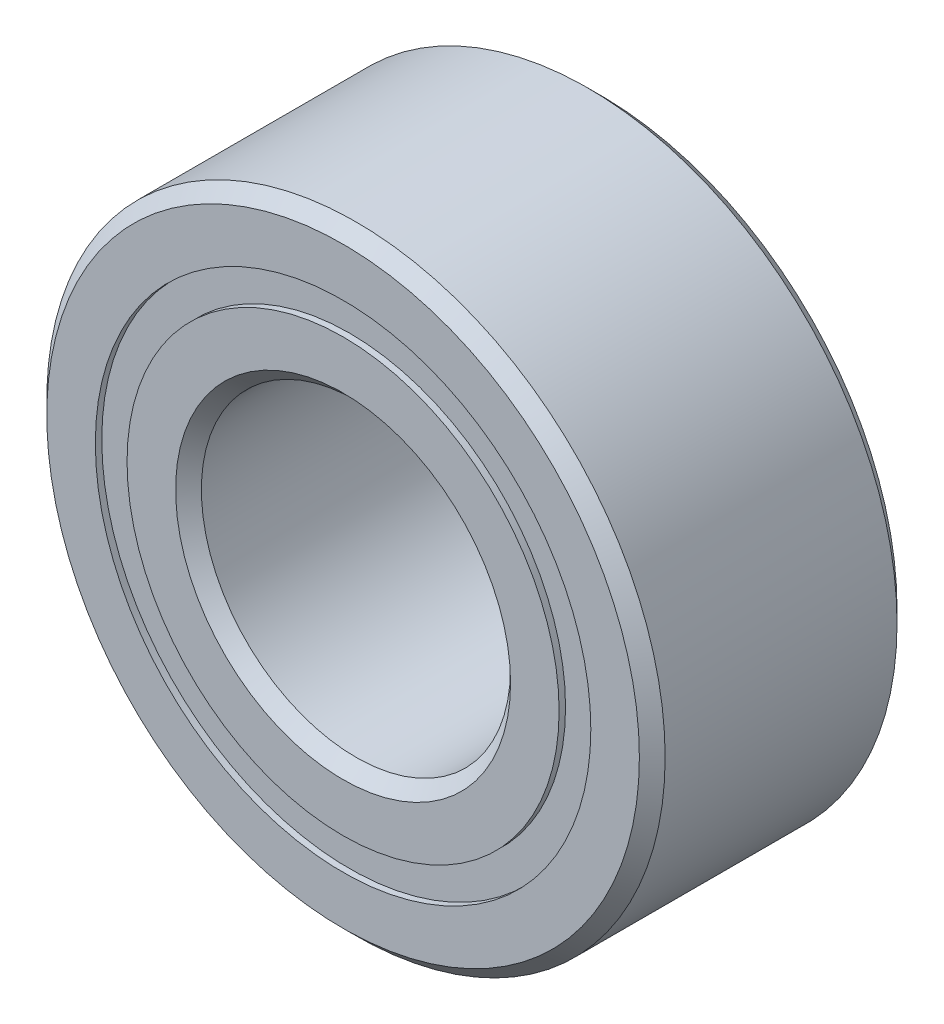
ISO-10303-21;
HEADER;
FILE_DESCRIPTION(('STEP AP214'),'2;1');
FILE_NAME('part.step','',(''),(''),'','','');
FILE_SCHEMA(('AUTOMOTIVE_DESIGN { 1 0 10303 214 1 1 1 1 }'));
ENDSEC;
DATA;
#1=APPLICATION_CONTEXT('core data for automotive mechanical design processes');
#2=APPLICATION_PROTOCOL_DEFINITION('international standard','automotive_design',2000,#1);
#3=PRODUCT_CONTEXT('',#1,'mechanical');
#4=PRODUCT('Part','Part','',(#3));
#5=PRODUCT_RELATED_PRODUCT_CATEGORY('part','',(#4));
#6=PRODUCT_DEFINITION_FORMATION('','',#4);
#7=PRODUCT_DEFINITION_CONTEXT('part definition',#1,'design');
#8=PRODUCT_DEFINITION('design','',#6,#7);
#9=PRODUCT_DEFINITION_SHAPE('','',#8);
#10=(LENGTH_UNIT() NAMED_UNIT(*) SI_UNIT(.MILLI.,.METRE.));
#11=(NAMED_UNIT(*) PLANE_ANGLE_UNIT() SI_UNIT($,.RADIAN.));
#12=(NAMED_UNIT(*) SI_UNIT($,.STERADIAN.) SOLID_ANGLE_UNIT());
#13=UNCERTAINTY_MEASURE_WITH_UNIT(LENGTH_MEASURE(1.E-05),#10,'distance_accuracy_value','');
#14=(GEOMETRIC_REPRESENTATION_CONTEXT(3) GLOBAL_UNCERTAINTY_ASSIGNED_CONTEXT((#13)) GLOBAL_UNIT_ASSIGNED_CONTEXT((#10,
#11,#12)) REPRESENTATION_CONTEXT('',''));
#15=CARTESIAN_POINT('',(0.,0.,0.));
#16=DIRECTION('',(0.,0.,1.));
#17=DIRECTION('',(1.,0.,0.));
#18=AXIS2_PLACEMENT_3D('',#15,#16,#17);
#19=CARTESIAN_POINT('',(0.,2.40384615384615,-1.1875));
#20=DIRECTION('',(0.,0.,1.));
#21=DIRECTION('',(1.,0.,0.));
#22=AXIS2_PLACEMENT_3D('',#19,#20,#21);
#23=PLANE('',#22);
#24=CARTESIAN_POINT('',(0.,0.,-1.1875));
#25=DIRECTION('',(0.,0.,1.));
#26=DIRECTION('',(1.,0.,0.));
#27=AXIS2_PLACEMENT_3D('',#24,#25,#26);
#28=CIRCLE('',#27,2.40384615384615);
#29=CARTESIAN_POINT('',(2.40384615384615,0.,-1.1875));
#30=VERTEX_POINT('',#29);
#31=EDGE_CURVE('E57',#30,#30,#28,.T.);
#32=ORIENTED_EDGE('',*,*,#31,.F.);
#33=EDGE_LOOP('',(#32));
#34=FACE_BOUND('',#33,.T.);
#35=CARTESIAN_POINT('',(0.,0.,-1.1875));
#36=DIRECTION('',(0.,0.,1.));
#37=DIRECTION('',(1.,0.,0.));
#38=AXIS2_PLACEMENT_3D('',#35,#36,#37);
#39=CIRCLE('',#38,2.09615384615385);
#40=CARTESIAN_POINT('',(2.09615384615385,0.,-1.1875));
#41=VERTEX_POINT('',#40);
#42=EDGE_CURVE('E11',#41,#41,#39,.T.);
#43=ORIENTED_EDGE('',*,*,#42,.T.);
#44=EDGE_LOOP('',(#43));
#45=FACE_BOUND('',#44,.T.);
#46=ADVANCED_FACE('F43',(#34,#45),#23,.F.);
#47=CARTESIAN_POINT('',(0.,0.,1.25));
#48=DIRECTION('',(0.,0.,1.));
#49=DIRECTION('',(1.,0.,0.));
#50=AXIS2_PLACEMENT_3D('',#47,#48,#49);
#51=CYLINDRICAL_SURFACE('',#50,2.09615384615385);
#52=ORIENTED_EDGE('',*,*,#42,.F.);
#53=EDGE_LOOP('',(#52));
#54=FACE_BOUND('',#53,.T.);
#55=CARTESIAN_POINT('',(0.,0.,-0.576463888168111));
#56=DIRECTION('',(0.,0.,1.));
#57=DIRECTION('',(1.,0.,0.));
#58=AXIS2_PLACEMENT_3D('',#55,#56,#57);
#59=CIRCLE('',#58,2.09615384615385);
#60=CARTESIAN_POINT('',(2.09615384615385,0.,-0.576463888168111));
#61=VERTEX_POINT('',#60);
#62=EDGE_CURVE('E49',#61,#61,#59,.T.);
#63=ORIENTED_EDGE('',*,*,#62,.T.);
#64=EDGE_LOOP('',(#63));
#65=FACE_BOUND('',#64,.T.);
#66=ADVANCED_FACE('F66',(#54,#65),#51,.F.);
#67=CARTESIAN_POINT('',(0.,2.40384615384615,-0.576463888168111));
#68=DIRECTION('',(0.,0.,-1.));
#69=DIRECTION('',(-1.,0.,0.));
#70=AXIS2_PLACEMENT_3D('',#67,#68,#69);
#71=PLANE('',#70);
#72=ORIENTED_EDGE('',*,*,#62,.F.);
#73=EDGE_LOOP('',(#72));
#74=FACE_BOUND('',#73,.T.);
#75=CARTESIAN_POINT('',(0.,0.,-0.576463888168111));
#76=DIRECTION('',(0.,0.,1.));
#77=DIRECTION('',(1.,0.,0.));
#78=AXIS2_PLACEMENT_3D('',#75,#76,#77);
#79=CIRCLE('',#78,2.40384615384615);
#80=CARTESIAN_POINT('',(2.40384615384615,0.,-0.576463888168111));
#81=VERTEX_POINT('',#80);
#82=EDGE_CURVE('E53',#81,#81,#79,.T.);
#83=ORIENTED_EDGE('',*,*,#82,.T.);
#84=EDGE_LOOP('',(#83));
#85=FACE_BOUND('',#84,.T.);
#86=ADVANCED_FACE('F70',(#74,#85),#71,.F.);
#87=CARTESIAN_POINT('',(0.,0.,1.25));
#88=DIRECTION('',(0.,0.,1.));
#89=DIRECTION('',(1.,0.,0.));
#90=AXIS2_PLACEMENT_3D('',#87,#88,#89);
#91=CYLINDRICAL_SURFACE('',#90,2.40384615384615);
#92=ORIENTED_EDGE('',*,*,#82,.F.);
#93=EDGE_LOOP('',(#92));
#94=FACE_BOUND('',#93,.T.);
#95=ORIENTED_EDGE('',*,*,#31,.T.);
#96=EDGE_LOOP('',(#95));
#97=FACE_BOUND('',#96,.T.);
#98=ADVANCED_FACE('F63',(#94,#97),#91,.T.);
#99=CLOSED_SHELL('',(#46,#66,#86,#98));
#100=MANIFOLD_SOLID_BREP('B2',#99);
#101=CARTESIAN_POINT('',(0.,2.40384615384615,1.1875));
#102=DIRECTION('',(0.,0.,-1.));
#103=DIRECTION('',(-1.,0.,0.));
#104=AXIS2_PLACEMENT_3D('',#101,#102,#103);
#105=PLANE('',#104);
#106=CARTESIAN_POINT('',(0.,0.,1.1875));
#107=DIRECTION('',(0.,0.,1.));
#108=DIRECTION('',(1.,0.,0.));
#109=AXIS2_PLACEMENT_3D('',#106,#107,#108);
#110=CIRCLE('',#109,2.09615384615385);
#111=CARTESIAN_POINT('',(2.09615384615385,0.,1.1875));
#112=VERTEX_POINT('',#111);
#113=EDGE_CURVE('E42',#112,#112,#110,.T.);
#114=ORIENTED_EDGE('',*,*,#113,.F.);
#115=EDGE_LOOP('',(#114));
#116=FACE_BOUND('',#115,.T.);
#117=CARTESIAN_POINT('',(0.,0.,1.1875));
#118=DIRECTION('',(0.,0.,1.));
#119=DIRECTION('',(1.,0.,0.));
#120=AXIS2_PLACEMENT_3D('',#117,#118,#119);
#121=CIRCLE('',#120,2.40384615384615);
#122=CARTESIAN_POINT('',(2.40384615384615,0.,1.1875));
#123=VERTEX_POINT('',#122);
#124=EDGE_CURVE('E124',#123,#123,#121,.T.);
#125=ORIENTED_EDGE('',*,*,#124,.T.);
#126=EDGE_LOOP('',(#125));
#127=FACE_BOUND('',#126,.T.);
#128=ADVANCED_FACE('F110',(#116,#127),#105,.F.);
#129=CARTESIAN_POINT('',(0.,0.,1.25));
#130=DIRECTION('',(0.,0.,1.));
#131=DIRECTION('',(1.,0.,0.));
#132=AXIS2_PLACEMENT_3D('',#129,#130,#131);
#133=CYLINDRICAL_SURFACE('',#132,2.09615384615385);
#134=CARTESIAN_POINT('',(0.,0.,0.576463888168111));
#135=DIRECTION('',(0.,0.,1.));
#136=DIRECTION('',(1.,0.,0.));
#137=AXIS2_PLACEMENT_3D('',#134,#135,#136);
#138=CIRCLE('',#137,2.09615384615385);
#139=CARTESIAN_POINT('',(2.09615384615385,0.,0.576463888168111));
#140=VERTEX_POINT('',#139);
#141=EDGE_CURVE('E116',#140,#140,#138,.T.);
#142=ORIENTED_EDGE('',*,*,#141,.F.);
#143=EDGE_LOOP('',(#142));
#144=FACE_BOUND('',#143,.T.);
#145=ORIENTED_EDGE('',*,*,#113,.T.);
#146=EDGE_LOOP('',(#145));
#147=FACE_BOUND('',#146,.T.);
#148=ADVANCED_FACE('F139',(#144,#147),#133,.F.);
#149=CARTESIAN_POINT('',(0.,2.40384615384615,0.576463888168111));
#150=DIRECTION('',(0.,0.,1.));
#151=DIRECTION('',(1.,0.,0.));
#152=AXIS2_PLACEMENT_3D('',#149,#150,#151);
#153=PLANE('',#152);
#154=CARTESIAN_POINT('',(0.,0.,0.576463888168111));
#155=DIRECTION('',(0.,0.,1.));
#156=DIRECTION('',(1.,0.,0.));
#157=AXIS2_PLACEMENT_3D('',#154,#155,#156);
#158=CIRCLE('',#157,2.40384615384615);
#159=CARTESIAN_POINT('',(2.40384615384615,0.,0.576463888168111));
#160=VERTEX_POINT('',#159);
#161=EDGE_CURVE('E120',#160,#160,#158,.T.);
#162=ORIENTED_EDGE('',*,*,#161,.F.);
#163=EDGE_LOOP('',(#162));
#164=FACE_BOUND('',#163,.T.);
#165=ORIENTED_EDGE('',*,*,#141,.T.);
#166=EDGE_LOOP('',(#165));
#167=FACE_BOUND('',#166,.T.);
#168=ADVANCED_FACE('F134',(#164,#167),#153,.F.);
#169=CARTESIAN_POINT('',(0.,0.,1.25));
#170=DIRECTION('',(0.,0.,1.));
#171=DIRECTION('',(1.,0.,0.));
#172=AXIS2_PLACEMENT_3D('',#169,#170,#171);
#173=CYLINDRICAL_SURFACE('',#172,2.40384615384615);
#174=ORIENTED_EDGE('',*,*,#124,.F.);
#175=EDGE_LOOP('',(#174));
#176=FACE_BOUND('',#175,.T.);
#177=ORIENTED_EDGE('',*,*,#161,.T.);
#178=EDGE_LOOP('',(#177));
#179=FACE_BOUND('',#178,.T.);
#180=ADVANCED_FACE('F131',(#176,#179),#173,.T.);
#181=CLOSED_SHELL('',(#128,#148,#168,#180));
#182=MANIFOLD_SOLID_BREP('B6',#181);
#183=CARTESIAN_POINT('',(-1.12499999999998,1.948557158515,0.));
#184=DIRECTION('',(0.,0.,1.));
#185=DIRECTION('',(-0.499999999999989,0.866025403784445,0.));
#186=AXIS2_PLACEMENT_3D('',#183,#184,#185);
#187=SPHERICAL_SURFACE('',#186,0.576463888168111);
#188=CARTESIAN_POINT('',(-1.12499999999998,1.948557158515,0.576463888168111));
#189=VERTEX_POINT('',#188);
#190=VERTEX_LOOP('',#189);
#191=FACE_BOUND('',#190,.T.);
#192=ADVANCED_FACE('F177',(#191),#187,.T.);
#193=CLOSED_SHELL('',(#192));
#194=MANIFOLD_SOLID_BREP('B37',#193);
#195=CARTESIAN_POINT('',(-1.94855715851497,1.12500000000002,0.));
#196=DIRECTION('',(0.,0.,1.));
#197=DIRECTION('',(-0.866025403784433,0.50000000000001,0.));
#198=AXIS2_PLACEMENT_3D('',#195,#196,#197);
#199=SPHERICAL_SURFACE('',#198,0.576463888168111);
#200=CARTESIAN_POINT('',(-1.94855715851497,1.12500000000002,0.576463888168111));
#201=VERTEX_POINT('',#200);
#202=VERTEX_LOOP('',#201);
#203=FACE_BOUND('',#202,.T.);
#204=ADVANCED_FACE('F197',(#203),#199,.T.);
#205=CLOSED_SHELL('',(#204));
#206=MANIFOLD_SOLID_BREP('B106',#205);
#207=CARTESIAN_POINT('',(-2.25,0.,0.));
#208=DIRECTION('',(0.,0.,1.));
#209=DIRECTION('',(-1.,0.,0.));
#210=AXIS2_PLACEMENT_3D('',#207,#208,#209);
#211=SPHERICAL_SURFACE('',#210,0.576463888168111);
#212=CARTESIAN_POINT('',(-2.25,0.,0.576463888168111));
#213=VERTEX_POINT('',#212);
#214=VERTEX_LOOP('',#213);
#215=FACE_BOUND('',#214,.T.);
#216=ADVANCED_FACE('F217',(#215),#211,.T.);
#217=CLOSED_SHELL('',(#216));
#218=MANIFOLD_SOLID_BREP('B173',#217);
#219=CARTESIAN_POINT('',(-1.948557158515,-1.12499999999998,0.));
#220=DIRECTION('',(0.,0.,1.));
#221=DIRECTION('',(-0.866025403784443,-0.499999999999992,0.));
#222=AXIS2_PLACEMENT_3D('',#219,#220,#221);
#223=SPHERICAL_SURFACE('',#222,0.576463888168111);
#224=CARTESIAN_POINT('',(-1.948557158515,-1.12499999999998,0.576463888168111));
#225=VERTEX_POINT('',#224);
#226=VERTEX_LOOP('',#225);
#227=FACE_BOUND('',#226,.T.);
#228=ADVANCED_FACE('F237',(#227),#223,.T.);
#229=CLOSED_SHELL('',(#228));
#230=MANIFOLD_SOLID_BREP('B193',#229);
#231=CARTESIAN_POINT('',(-1.12500000000002,-1.94855715851498,0.));
#232=DIRECTION('',(0.,0.,1.));
#233=DIRECTION('',(-0.500000000000007,-0.866025403784435,0.));
#234=AXIS2_PLACEMENT_3D('',#231,#232,#233);
#235=SPHERICAL_SURFACE('',#234,0.576463888168111);
#236=CARTESIAN_POINT('',(-1.12500000000002,-1.94855715851498,0.576463888168111));
#237=VERTEX_POINT('',#236);
#238=VERTEX_LOOP('',#237);
#239=FACE_BOUND('',#238,.T.);
#240=ADVANCED_FACE('F257',(#239),#235,.T.);
#241=CLOSED_SHELL('',(#240));
#242=MANIFOLD_SOLID_BREP('B213',#241);
#243=CARTESIAN_POINT('',(0.,-2.25,0.));
#244=DIRECTION('',(0.,0.,1.));
#245=DIRECTION('',(0.,-1.,0.));
#246=AXIS2_PLACEMENT_3D('',#243,#244,#245);
#247=SPHERICAL_SURFACE('',#246,0.576463888168111);
#248=CARTESIAN_POINT('',(0.,-2.25,0.576463888168111));
#249=VERTEX_POINT('',#248);
#250=VERTEX_LOOP('',#249);
#251=FACE_BOUND('',#250,.T.);
#252=ADVANCED_FACE('F277',(#251),#247,.T.);
#253=CLOSED_SHELL('',(#252));
#254=MANIFOLD_SOLID_BREP('B233',#253);
#255=CARTESIAN_POINT('',(1.12499999999999,-1.94855715851499,0.));
#256=DIRECTION('',(0.,0.,1.));
#257=DIRECTION('',(0.499999999999995,-0.866025403784442,0.));
#258=AXIS2_PLACEMENT_3D('',#255,#256,#257);
#259=SPHERICAL_SURFACE('',#258,0.576463888168111);
#260=CARTESIAN_POINT('',(1.12499999999999,-1.94855715851499,0.576463888168111));
#261=VERTEX_POINT('',#260);
#262=VERTEX_LOOP('',#261);
#263=FACE_BOUND('',#262,.T.);
#264=ADVANCED_FACE('F297',(#263),#259,.T.);
#265=CLOSED_SHELL('',(#264));
#266=MANIFOLD_SOLID_BREP('B253',#265);
#267=CARTESIAN_POINT('',(1.94855715851498,-1.12500000000001,0.));
#268=DIRECTION('',(0.,0.,1.));
#269=DIRECTION('',(0.866025403784436,-0.500000000000004,0.));
#270=AXIS2_PLACEMENT_3D('',#267,#268,#269);
#271=SPHERICAL_SURFACE('',#270,0.576463888168111);
#272=CARTESIAN_POINT('',(1.94855715851498,-1.12500000000001,0.576463888168111));
#273=VERTEX_POINT('',#272);
#274=VERTEX_LOOP('',#273);
#275=FACE_BOUND('',#274,.T.);
#276=ADVANCED_FACE('F317',(#275),#271,.T.);
#277=CLOSED_SHELL('',(#276));
#278=MANIFOLD_SOLID_BREP('B273',#277);
#279=CARTESIAN_POINT('',(2.25,0.,0.));
#280=DIRECTION('',(0.,0.,1.));
#281=DIRECTION('',(1.,0.,0.));
#282=AXIS2_PLACEMENT_3D('',#279,#280,#281);
#283=SPHERICAL_SURFACE('',#282,0.576463888168111);
#284=CARTESIAN_POINT('',(2.25,0.,0.576463888168111));
#285=VERTEX_POINT('',#284);
#286=VERTEX_LOOP('',#285);
#287=FACE_BOUND('',#286,.T.);
#288=ADVANCED_FACE('F337',(#287),#283,.T.);
#289=CLOSED_SHELL('',(#288));
#290=MANIFOLD_SOLID_BREP('B293',#289);
#291=CARTESIAN_POINT('',(1.94855715851499,1.125,0.));
#292=DIRECTION('',(0.,0.,1.));
#293=DIRECTION('',(0.86602540378444,0.499999999999998,0.));
#294=AXIS2_PLACEMENT_3D('',#291,#292,#293);
#295=SPHERICAL_SURFACE('',#294,0.576463888168111);
#296=CARTESIAN_POINT('',(1.94855715851499,1.125,0.576463888168111));
#297=VERTEX_POINT('',#296);
#298=VERTEX_LOOP('',#297);
#299=FACE_BOUND('',#298,.T.);
#300=ADVANCED_FACE('F357',(#299),#295,.T.);
#301=CLOSED_SHELL('',(#300));
#302=MANIFOLD_SOLID_BREP('B313',#301);
#303=CARTESIAN_POINT('',(1.125,1.94855715851499,0.));
#304=DIRECTION('',(0.,0.,1.));
#305=DIRECTION('',(0.500000000000001,0.866025403784438,0.));
#306=AXIS2_PLACEMENT_3D('',#303,#304,#305);
#307=SPHERICAL_SURFACE('',#306,0.576463888168111);
#308=CARTESIAN_POINT('',(1.125,1.94855715851499,0.576463888168111));
#309=VERTEX_POINT('',#308);
#310=VERTEX_LOOP('',#309);
#311=FACE_BOUND('',#310,.T.);
#312=ADVANCED_FACE('F377',(#311),#307,.T.);
#313=CLOSED_SHELL('',(#312));
#314=MANIFOLD_SOLID_BREP('B333',#313);
#315=CARTESIAN_POINT('',(0.,2.25,0.));
#316=DIRECTION('',(0.,0.,1.));
#317=DIRECTION('',(0.,1.,0.));
#318=AXIS2_PLACEMENT_3D('',#315,#316,#317);
#319=SPHERICAL_SURFACE('',#318,0.576463888168111);
#320=CARTESIAN_POINT('',(0.,2.25,0.576463888168111));
#321=VERTEX_POINT('',#320);
#322=VERTEX_LOOP('',#321);
#323=FACE_BOUND('',#322,.T.);
#324=ADVANCED_FACE('F399',(#323),#319,.T.);
#325=CLOSED_SHELL('',(#324));
#326=MANIFOLD_SOLID_BREP('B353',#325);
#327=CARTESIAN_POINT('',(0.,2.09615384615385,1.25));
#328=DIRECTION('',(0.,0.,-1.));
#329=DIRECTION('',(-1.,0.,0.));
#330=AXIS2_PLACEMENT_3D('',#327,#328,#329);
#331=PLANE('',#330);
#332=CARTESIAN_POINT('',(0.,0.,1.25));
#333=DIRECTION('',(0.,0.,1.));
#334=DIRECTION('',(1.,0.,0.));
#335=AXIS2_PLACEMENT_3D('',#332,#333,#334);
#336=CIRCLE('',#335,1.625);
#337=CARTESIAN_POINT('',(1.625,0.,1.25));
#338=VERTEX_POINT('',#337);
#339=EDGE_CURVE('E446',#338,#338,#336,.T.);
#340=ORIENTED_EDGE('',*,*,#339,.F.);
#341=EDGE_LOOP('',(#340));
#342=FACE_BOUND('',#341,.T.);
#343=CARTESIAN_POINT('',(0.,0.,1.25));
#344=DIRECTION('',(0.,0.,1.));
#345=DIRECTION('',(1.,0.,0.));
#346=AXIS2_PLACEMENT_3D('',#343,#344,#345);
#347=CIRCLE('',#346,2.09615384615385);
#348=CARTESIAN_POINT('',(2.09615384615385,0.,1.25));
#349=VERTEX_POINT('',#348);
#350=EDGE_CURVE('E398',#349,#349,#347,.T.);
#351=ORIENTED_EDGE('',*,*,#350,.T.);
#352=EDGE_LOOP('',(#351));
#353=FACE_BOUND('',#352,.T.);
#354=ADVANCED_FACE('F418',(#342,#353),#331,.F.);
#355=CARTESIAN_POINT('',(0.,0.,1.25));
#356=DIRECTION('',(0.,0.,1.));
#357=DIRECTION('',(1.,0.,0.));
#358=AXIS2_PLACEMENT_3D('',#355,#356,#357);
#359=CYLINDRICAL_SURFACE('',#358,2.09615384615385);
#360=ORIENTED_EDGE('',*,*,#350,.F.);
#361=EDGE_LOOP('',(#360));
#362=FACE_BOUND('',#361,.T.);
#363=CARTESIAN_POINT('',(0.,0.,0.555555555555555));
#364=DIRECTION('',(0.,0.,1.));
#365=DIRECTION('',(1.,0.,0.));
#366=AXIS2_PLACEMENT_3D('',#363,#364,#365);
#367=CIRCLE('',#366,2.09615384615385);
#368=CARTESIAN_POINT('',(2.09615384615385,0.,0.555555555555555));
#369=VERTEX_POINT('',#368);
#370=EDGE_CURVE('E424',#369,#369,#367,.T.);
#371=ORIENTED_EDGE('',*,*,#370,.T.);
#372=EDGE_LOOP('',(#371));
#373=FACE_BOUND('',#372,.T.);
#374=ADVANCED_FACE('F453',(#362,#373),#359,.T.);
#375=CARTESIAN_POINT('',(0.,0.,0.));
#376=DIRECTION('',(0.,0.,1.));
#377=DIRECTION('',(1.,0.,0.));
#378=AXIS2_PLACEMENT_3D('',#375,#376,#377);
#379=TOROIDAL_SURFACE('',#378,2.25,0.57646388816811);
#380=ORIENTED_EDGE('',*,*,#370,.F.);
#381=EDGE_LOOP('',(#380));
#382=FACE_BOUND('',#381,.T.);
#383=CARTESIAN_POINT('',(0.,0.,-0.555555555555556));
#384=DIRECTION('',(0.,0.,1.));
#385=DIRECTION('',(1.,0.,0.));
#386=AXIS2_PLACEMENT_3D('',#383,#384,#385);
#387=CIRCLE('',#386,2.09615384615385);
#388=CARTESIAN_POINT('',(2.09615384615385,0.,-0.555555555555556));
#389=VERTEX_POINT('',#388);
#390=EDGE_CURVE('E428',#389,#389,#387,.T.);
#391=ORIENTED_EDGE('',*,*,#390,.T.);
#392=EDGE_LOOP('',(#391));
#393=FACE_BOUND('',#392,.T.);
#394=ADVANCED_FACE('F457',(#382,#393),#379,.F.);
#395=CARTESIAN_POINT('',(0.,0.,1.25));
#396=DIRECTION('',(0.,0.,1.));
#397=DIRECTION('',(1.,0.,0.));
#398=AXIS2_PLACEMENT_3D('',#395,#396,#397);
#399=CYLINDRICAL_SURFACE('',#398,2.09615384615385);
#400=ORIENTED_EDGE('',*,*,#390,.F.);
#401=EDGE_LOOP('',(#400));
#402=FACE_BOUND('',#401,.T.);
#403=CARTESIAN_POINT('',(0.,0.,-1.25));
#404=DIRECTION('',(0.,0.,1.));
#405=DIRECTION('',(1.,0.,0.));
#406=AXIS2_PLACEMENT_3D('',#403,#404,#405);
#407=CIRCLE('',#406,2.09615384615385);
#408=CARTESIAN_POINT('',(2.09615384615385,0.,-1.25));
#409=VERTEX_POINT('',#408);
#410=EDGE_CURVE('E432',#409,#409,#407,.T.);
#411=ORIENTED_EDGE('',*,*,#410,.T.);
#412=EDGE_LOOP('',(#411));
#413=FACE_BOUND('',#412,.T.);
#414=ADVANCED_FACE('F462',(#402,#413),#399,.T.);
#415=CARTESIAN_POINT('',(0.,1.625,-1.25));
#416=DIRECTION('',(0.,0.,1.));
#417=DIRECTION('',(1.,0.,0.));
#418=AXIS2_PLACEMENT_3D('',#415,#416,#417);
#419=PLANE('',#418);
#420=ORIENTED_EDGE('',*,*,#410,.F.);
#421=EDGE_LOOP('',(#420));
#422=FACE_BOUND('',#421,.T.);
#423=CARTESIAN_POINT('',(0.,0.,-1.25));
#424=DIRECTION('',(0.,0.,1.));
#425=DIRECTION('',(1.,0.,0.));
#426=AXIS2_PLACEMENT_3D('',#423,#424,#425);
#427=CIRCLE('',#426,1.625);
#428=CARTESIAN_POINT('',(1.625,0.,-1.25));
#429=VERTEX_POINT('',#428);
#430=EDGE_CURVE('E437',#429,#429,#427,.T.);
#431=ORIENTED_EDGE('',*,*,#430,.T.);
#432=EDGE_LOOP('',(#431));
#433=FACE_BOUND('',#432,.T.);
#434=ADVANCED_FACE('F468',(#422,#433),#419,.F.);
#435=CARTESIAN_POINT('',(0.,0.,-1.125));
#436=DIRECTION('',(0.,0.,-1.));
#437=DIRECTION('',(-1.,0.,0.));
#438=AXIS2_PLACEMENT_3D('',#435,#436,#437);
#439=CONICAL_SURFACE('',#438,1.5,0.785398163397449);
#440=ORIENTED_EDGE('',*,*,#430,.F.);
#441=EDGE_LOOP('',(#440));
#442=FACE_BOUND('',#441,.T.);
#443=CARTESIAN_POINT('',(0.,0.,-1.125));
#444=DIRECTION('',(0.,0.,1.));
#445=DIRECTION('',(1.,0.,0.));
#446=AXIS2_PLACEMENT_3D('',#443,#444,#445);
#447=CIRCLE('',#446,1.5);
#448=CARTESIAN_POINT('',(1.5,0.,-1.125));
#449=VERTEX_POINT('',#448);
#450=EDGE_CURVE('E440',#449,#449,#447,.T.);
#451=ORIENTED_EDGE('',*,*,#450,.T.);
#452=EDGE_LOOP('',(#451));
#453=FACE_BOUND('',#452,.T.);
#454=ADVANCED_FACE('F472',(#442,#453),#439,.F.);
#455=CARTESIAN_POINT('',(0.,0.,1.25));
#456=DIRECTION('',(0.,0.,1.));
#457=DIRECTION('',(1.,0.,0.));
#458=AXIS2_PLACEMENT_3D('',#455,#456,#457);
#459=CYLINDRICAL_SURFACE('',#458,1.5);
#460=ORIENTED_EDGE('',*,*,#450,.F.);
#461=EDGE_LOOP('',(#460));
#462=FACE_BOUND('',#461,.T.);
#463=CARTESIAN_POINT('',(0.,0.,1.125));
#464=DIRECTION('',(0.,0.,1.));
#465=DIRECTION('',(1.,0.,0.));
#466=AXIS2_PLACEMENT_3D('',#463,#464,#465);
#467=CIRCLE('',#466,1.5);
#468=CARTESIAN_POINT('',(1.5,0.,1.125));
#469=VERTEX_POINT('',#468);
#470=EDGE_CURVE('E443',#469,#469,#467,.T.);
#471=ORIENTED_EDGE('',*,*,#470,.T.);
#472=EDGE_LOOP('',(#471));
#473=FACE_BOUND('',#472,.T.);
#474=ADVANCED_FACE('F476',(#462,#473),#459,.F.);
#475=CARTESIAN_POINT('',(0.,0.,1.25));
#476=DIRECTION('',(0.,0.,1.));
#477=DIRECTION('',(1.,0.,0.));
#478=AXIS2_PLACEMENT_3D('',#475,#476,#477);
#479=CONICAL_SURFACE('',#478,1.625,0.785398163397448);
#480=ORIENTED_EDGE('',*,*,#470,.F.);
#481=EDGE_LOOP('',(#480));
#482=FACE_BOUND('',#481,.T.);
#483=ORIENTED_EDGE('',*,*,#339,.T.);
#484=EDGE_LOOP('',(#483));
#485=FACE_BOUND('',#484,.T.);
#486=ADVANCED_FACE('F450',(#482,#485),#479,.F.);
#487=CLOSED_SHELL('',(#354,#374,#394,#414,#434,#454,#474,#486));
#488=MANIFOLD_SOLID_BREP('B373',#487);
#489=CARTESIAN_POINT('',(0.,0.,1.125));
#490=DIRECTION('',(0.,0.,-1.));
#491=DIRECTION('',(-1.,0.,0.));
#492=AXIS2_PLACEMENT_3D('',#489,#490,#491);
#493=CONICAL_SURFACE('',#492,3.,0.785398163397449);
#494=CARTESIAN_POINT('',(0.,0.,1.25));
#495=DIRECTION('',(0.,0.,1.));
#496=DIRECTION('',(1.,0.,0.));
#497=AXIS2_PLACEMENT_3D('',#494,#495,#496);
#498=CIRCLE('',#497,2.875);
#499=CARTESIAN_POINT('',(2.875,0.,1.25));
#500=VERTEX_POINT('',#499);
#501=EDGE_CURVE('E567',#500,#500,#498,.T.);
#502=ORIENTED_EDGE('',*,*,#501,.F.);
#503=EDGE_LOOP('',(#502));
#504=FACE_BOUND('',#503,.T.);
#505=CARTESIAN_POINT('',(0.,0.,1.125));
#506=DIRECTION('',(0.,0.,1.));
#507=DIRECTION('',(1.,0.,0.));
#508=AXIS2_PLACEMENT_3D('',#505,#506,#507);
#509=CIRCLE('',#508,3.);
#510=CARTESIAN_POINT('',(3.,0.,1.125));
#511=VERTEX_POINT('',#510);
#512=EDGE_CURVE('E417',#511,#511,#509,.T.);
#513=ORIENTED_EDGE('',*,*,#512,.T.);
#514=EDGE_LOOP('',(#513));
#515=FACE_BOUND('',#514,.T.);
#516=ADVANCED_FACE('F539',(#504,#515),#493,.T.);
#517=CARTESIAN_POINT('',(0.,0.,1.25));
#518=DIRECTION('',(0.,0.,1.));
#519=DIRECTION('',(1.,0.,0.));
#520=AXIS2_PLACEMENT_3D('',#517,#518,#519);
#521=CYLINDRICAL_SURFACE('',#520,3.);
#522=ORIENTED_EDGE('',*,*,#512,.F.);
#523=EDGE_LOOP('',(#522));
#524=FACE_BOUND('',#523,.T.);
#525=CARTESIAN_POINT('',(0.,0.,-1.125));
#526=DIRECTION('',(0.,0.,1.));
#527=DIRECTION('',(1.,0.,0.));
#528=AXIS2_PLACEMENT_3D('',#525,#526,#527);
#529=CIRCLE('',#528,3.);
#530=CARTESIAN_POINT('',(3.,0.,-1.125));
#531=VERTEX_POINT('',#530);
#532=EDGE_CURVE('E545',#531,#531,#529,.T.);
#533=ORIENTED_EDGE('',*,*,#532,.T.);
#534=EDGE_LOOP('',(#533));
#535=FACE_BOUND('',#534,.T.);
#536=ADVANCED_FACE('F574',(#524,#535),#521,.T.);
#537=CARTESIAN_POINT('',(0.,0.,-1.25));
#538=DIRECTION('',(0.,0.,1.));
#539=DIRECTION('',(1.,0.,0.));
#540=AXIS2_PLACEMENT_3D('',#537,#538,#539);
#541=CONICAL_SURFACE('',#540,2.875,0.78539816339745);
#542=ORIENTED_EDGE('',*,*,#532,.F.);
#543=EDGE_LOOP('',(#542));
#544=FACE_BOUND('',#543,.T.);
#545=CARTESIAN_POINT('',(0.,0.,-1.25));
#546=DIRECTION('',(0.,0.,1.));
#547=DIRECTION('',(1.,0.,0.));
#548=AXIS2_PLACEMENT_3D('',#545,#546,#547);
#549=CIRCLE('',#548,2.875);
#550=CARTESIAN_POINT('',(2.875,0.,-1.25));
#551=VERTEX_POINT('',#550);
#552=EDGE_CURVE('E549',#551,#551,#549,.T.);
#553=ORIENTED_EDGE('',*,*,#552,.T.);
#554=EDGE_LOOP('',(#553));
#555=FACE_BOUND('',#554,.T.);
#556=ADVANCED_FACE('F578',(#544,#555),#541,.T.);
#557=CARTESIAN_POINT('',(0.,2.875,-1.25));
#558=DIRECTION('',(0.,0.,1.));
#559=DIRECTION('',(1.,0.,0.));
#560=AXIS2_PLACEMENT_3D('',#557,#558,#559);
#561=PLANE('',#560);
#562=ORIENTED_EDGE('',*,*,#552,.F.);
#563=EDGE_LOOP('',(#562));
#564=FACE_BOUND('',#563,.T.);
#565=CARTESIAN_POINT('',(0.,0.,-1.25));
#566=DIRECTION('',(0.,0.,1.));
#567=DIRECTION('',(1.,0.,0.));
#568=AXIS2_PLACEMENT_3D('',#565,#566,#567);
#569=CIRCLE('',#568,2.40384615384615);
#570=CARTESIAN_POINT('',(2.40384615384615,0.,-1.25));
#571=VERTEX_POINT('',#570);
#572=EDGE_CURVE('E553',#571,#571,#569,.T.);
#573=ORIENTED_EDGE('',*,*,#572,.T.);
#574=EDGE_LOOP('',(#573));
#575=FACE_BOUND('',#574,.T.);
#576=ADVANCED_FACE('F583',(#564,#575),#561,.F.);
#577=CARTESIAN_POINT('',(0.,0.,1.25));
#578=DIRECTION('',(0.,0.,1.));
#579=DIRECTION('',(1.,0.,0.));
#580=AXIS2_PLACEMENT_3D('',#577,#578,#579);
#581=CYLINDRICAL_SURFACE('',#580,2.40384615384615);
#582=ORIENTED_EDGE('',*,*,#572,.F.);
#583=EDGE_LOOP('',(#582));
#584=FACE_BOUND('',#583,.T.);
#585=CARTESIAN_POINT('',(0.,0.,-0.555555555555556));
#586=DIRECTION('',(0.,0.,1.));
#587=DIRECTION('',(1.,0.,0.));
#588=AXIS2_PLACEMENT_3D('',#585,#586,#587);
#589=CIRCLE('',#588,2.40384615384615);
#590=CARTESIAN_POINT('',(2.40384615384615,0.,-0.555555555555556));
#591=VERTEX_POINT('',#590);
#592=EDGE_CURVE('E558',#591,#591,#589,.T.);
#593=ORIENTED_EDGE('',*,*,#592,.T.);
#594=EDGE_LOOP('',(#593));
#595=FACE_BOUND('',#594,.T.);
#596=ADVANCED_FACE('F589',(#584,#595),#581,.F.);
#597=CARTESIAN_POINT('',(0.,0.,0.));
#598=DIRECTION('',(0.,0.,1.));
#599=DIRECTION('',(1.,0.,0.));
#600=AXIS2_PLACEMENT_3D('',#597,#598,#599);
#601=TOROIDAL_SURFACE('',#600,2.25,0.576463888168111);
#602=ORIENTED_EDGE('',*,*,#592,.F.);
#603=EDGE_LOOP('',(#602));
#604=FACE_BOUND('',#603,.T.);
#605=CARTESIAN_POINT('',(0.,0.,0.555555555555555));
#606=DIRECTION('',(0.,0.,1.));
#607=DIRECTION('',(1.,0.,0.));
#608=AXIS2_PLACEMENT_3D('',#605,#606,#607);
#609=CIRCLE('',#608,2.40384615384615);
#610=CARTESIAN_POINT('',(2.40384615384615,0.,0.555555555555555));
#611=VERTEX_POINT('',#610);
#612=EDGE_CURVE('E561',#611,#611,#609,.T.);
#613=ORIENTED_EDGE('',*,*,#612,.T.);
#614=EDGE_LOOP('',(#613));
#615=FACE_BOUND('',#614,.T.);
#616=ADVANCED_FACE('F593',(#604,#615),#601,.F.);
#617=CARTESIAN_POINT('',(0.,0.,1.25));
#618=DIRECTION('',(0.,0.,1.));
#619=DIRECTION('',(1.,0.,0.));
#620=AXIS2_PLACEMENT_3D('',#617,#618,#619);
#621=CYLINDRICAL_SURFACE('',#620,2.40384615384615);
#622=ORIENTED_EDGE('',*,*,#612,.F.);
#623=EDGE_LOOP('',(#622));
#624=FACE_BOUND('',#623,.T.);
#625=CARTESIAN_POINT('',(0.,0.,1.25));
#626=DIRECTION('',(0.,0.,1.));
#627=DIRECTION('',(1.,0.,0.));
#628=AXIS2_PLACEMENT_3D('',#625,#626,#627);
#629=CIRCLE('',#628,2.40384615384615);
#630=CARTESIAN_POINT('',(2.40384615384615,0.,1.25));
#631=VERTEX_POINT('',#630);
#632=EDGE_CURVE('E564',#631,#631,#629,.T.);
#633=ORIENTED_EDGE('',*,*,#632,.T.);
#634=EDGE_LOOP('',(#633));
#635=FACE_BOUND('',#634,.T.);
#636=ADVANCED_FACE('F597',(#624,#635),#621,.F.);
#637=CARTESIAN_POINT('',(0.,2.875,1.25));
#638=DIRECTION('',(0.,0.,-1.));
#639=DIRECTION('',(-1.,0.,0.));
#640=AXIS2_PLACEMENT_3D('',#637,#638,#639);
#641=PLANE('',#640);
#642=ORIENTED_EDGE('',*,*,#632,.F.);
#643=EDGE_LOOP('',(#642));
#644=FACE_BOUND('',#643,.T.);
#645=ORIENTED_EDGE('',*,*,#501,.T.);
#646=EDGE_LOOP('',(#645));
#647=FACE_BOUND('',#646,.T.);
#648=ADVANCED_FACE('F571',(#644,#647),#641,.F.);
#649=CLOSED_SHELL('',(#516,#536,#556,#576,#596,#616,#636,#648));
#650=MANIFOLD_SOLID_BREP('B393',#649);
#651=ADVANCED_BREP_SHAPE_REPRESENTATION('',(#18,#100,#182,#194,#206,#218,#230,#242,#254,#266,
#278,#290,#302,#314,#326,#488,#650),#14);
#652=SHAPE_DEFINITION_REPRESENTATION(#9,#651);
ENDSEC;
END-ISO-10303-21;
